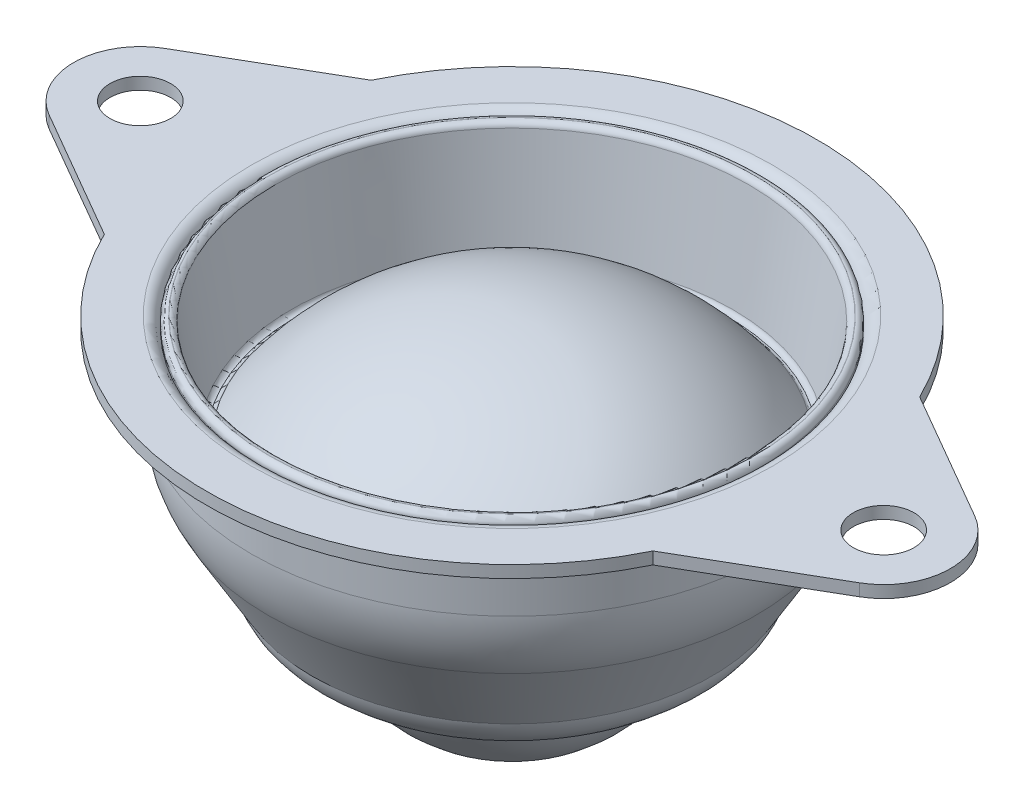
ISO-10303-21;
HEADER;
FILE_DESCRIPTION(('STEP AP214'),'2;1');
FILE_NAME('part.step','',(''),(''),'','','');
FILE_SCHEMA(('AUTOMOTIVE_DESIGN { 1 0 10303 214 1 1 1 1 }'));
ENDSEC;
DATA;
#1=APPLICATION_CONTEXT('core data for automotive mechanical design processes');
#2=APPLICATION_PROTOCOL_DEFINITION('international standard','automotive_design',2000,#1);
#3=PRODUCT_CONTEXT('',#1,'mechanical');
#4=PRODUCT('Part','Part','',(#3));
#5=PRODUCT_RELATED_PRODUCT_CATEGORY('part','',(#4));
#6=PRODUCT_DEFINITION_FORMATION('','',#4);
#7=PRODUCT_DEFINITION_CONTEXT('part definition',#1,'design');
#8=PRODUCT_DEFINITION('design','',#6,#7);
#9=PRODUCT_DEFINITION_SHAPE('','',#8);
#10=(LENGTH_UNIT() NAMED_UNIT(*) SI_UNIT(.MILLI.,.METRE.));
#11=(NAMED_UNIT(*) PLANE_ANGLE_UNIT() SI_UNIT($,.RADIAN.));
#12=(NAMED_UNIT(*) SI_UNIT($,.STERADIAN.) SOLID_ANGLE_UNIT());
#13=UNCERTAINTY_MEASURE_WITH_UNIT(LENGTH_MEASURE(1.E-05),#10,'distance_accuracy_value','');
#14=(GEOMETRIC_REPRESENTATION_CONTEXT(3) GLOBAL_UNCERTAINTY_ASSIGNED_CONTEXT((#13)) GLOBAL_UNIT_ASSIGNED_CONTEXT((#10,
#11,#12)) REPRESENTATION_CONTEXT('',''));
#15=CARTESIAN_POINT('',(0.,0.,0.));
#16=DIRECTION('',(0.,0.,1.));
#17=DIRECTION('',(1.,0.,0.));
#18=AXIS2_PLACEMENT_3D('',#15,#16,#17);
#19=CARTESIAN_POINT('',(0.,-16.85,0.));
#20=DIRECTION('',(0.,1.,0.));
#21=DIRECTION('',(0.,0.,1.));
#22=AXIS2_PLACEMENT_3D('',#19,#20,#21);
#23=SPHERICAL_SURFACE('',#22,12.25);
#24=CARTESIAN_POINT('',(0.,-4.6,0.));
#25=VERTEX_POINT('',#24);
#26=VERTEX_LOOP('',#25);
#27=FACE_BOUND('',#26,.T.);
#28=ADVANCED_FACE('F39',(#27),#23,.T.);
#29=CLOSED_SHELL('',(#28));
#30=MANIFOLD_SOLID_BREP('B2',#29);
#31=CARTESIAN_POINT('',(0.,-21.7088888888889,0.));
#32=DIRECTION('',(0.,1.,0.));
#33=DIRECTION('',(0.,0.,1.));
#34=AXIS2_PLACEMENT_3D('',#31,#32,#33);
#35=SPHERICAL_SURFACE('',#34,21.7088888888889);
#36=CARTESIAN_POINT('',(0.,-8.83716956478038,0.));
#37=DIRECTION('',(0.,1.,0.));
#38=DIRECTION('',(0.,0.,1.));
#39=AXIS2_PLACEMENT_3D('',#36,#37,#38);
#40=CIRCLE('',#39,17.4812670716826);
#41=CARTESIAN_POINT('',(0.,-8.83716956478038,17.4812670716826));
#42=VERTEX_POINT('',#41);
#43=EDGE_CURVE('E94',#42,#42,#40,.T.);
#44=ORIENTED_EDGE('',*,*,#43,.T.);
#45=EDGE_LOOP('',(#44));
#46=FACE_BOUND('',#45,.T.);
#47=ADVANCED_FACE('F60',(#46),#35,.T.);
#48=CARTESIAN_POINT('',(0.,-22.7088888888889,0.));
#49=DIRECTION('',(0.,1.,0.));
#50=DIRECTION('',(0.,0.,1.));
#51=AXIS2_PLACEMENT_3D('',#48,#49,#50);
#52=SPHERICAL_SURFACE('',#51,21.7088888888889);
#53=CARTESIAN_POINT('',(0.,-10.,0.));
#54=DIRECTION('',(0.,1.,0.));
#55=DIRECTION('',(0.,0.,1.));
#56=AXIS2_PLACEMENT_3D('',#53,#54,#55);
#57=CIRCLE('',#56,17.6);
#58=CARTESIAN_POINT('',(0.,-10.,17.6));
#59=VERTEX_POINT('',#58);
#60=EDGE_CURVE('E38',#59,#59,#57,.T.);
#61=ORIENTED_EDGE('',*,*,#60,.F.);
#62=EDGE_LOOP('',(#61));
#63=FACE_BOUND('',#62,.T.);
#64=ADVANCED_FACE('F111',(#63),#52,.F.);
#65=CARTESIAN_POINT('',(0.,-10.,19.));
#66=DIRECTION('',(0.,-1.,0.));
#67=DIRECTION('',(0.,0.,-1.));
#68=AXIS2_PLACEMENT_3D('',#65,#66,#67);
#69=PLANE('',#68);
#70=ORIENTED_EDGE('',*,*,#60,.T.);
#71=EDGE_LOOP('',(#70));
#72=FACE_BOUND('',#71,.T.);
#73=CARTESIAN_POINT('',(0.,-10.,0.));
#74=DIRECTION('',(0.,1.,0.));
#75=DIRECTION('',(0.,0.,1.));
#76=AXIS2_PLACEMENT_3D('',#73,#74,#75);
#77=CIRCLE('',#76,19.);
#78=CARTESIAN_POINT('',(0.,-10.,19.));
#79=VERTEX_POINT('',#78);
#80=EDGE_CURVE('E66',#79,#79,#77,.T.);
#81=ORIENTED_EDGE('',*,*,#80,.F.);
#82=EDGE_LOOP('',(#81));
#83=FACE_BOUND('',#82,.T.);
#84=ADVANCED_FACE('F115',(#72,#83),#69,.T.);
#85=CARTESIAN_POINT('',(0.,-0.567415345542272,0.));
#86=DIRECTION('',(0.,1.,0.));
#87=DIRECTION('',(0.,0.,1.));
#88=AXIS2_PLACEMENT_3D('',#85,#86,#87);
#89=CONICAL_SURFACE('',#88,20.5092135447132,0.158655262186401);
#90=ORIENTED_EDGE('',*,*,#80,.T.);
#91=EDGE_LOOP('',(#90));
#92=FACE_BOUND('',#91,.T.);
#93=CARTESIAN_POINT('',(0.,-0.567415345542272,0.));
#94=DIRECTION('',(0.,1.,0.));
#95=DIRECTION('',(0.,0.,1.));
#96=AXIS2_PLACEMENT_3D('',#93,#94,#95);
#97=CIRCLE('',#96,20.5092135447132);
#98=CARTESIAN_POINT('',(0.,-0.567415345542271,20.5092135447132));
#99=VERTEX_POINT('',#98);
#100=EDGE_CURVE('E70',#99,#99,#97,.T.);
#101=ORIENTED_EDGE('',*,*,#100,.F.);
#102=EDGE_LOOP('',(#101));
#103=FACE_BOUND('',#102,.T.);
#104=ADVANCED_FACE('F120',(#92,#103),#89,.T.);
#105=CARTESIAN_POINT('',(0.,-0.489999999999999,0.));
#106=DIRECTION('',(0.,1.,0.));
#107=DIRECTION('',(0.,0.,1.));
#108=AXIS2_PLACEMENT_3D('',#105,#106,#107);
#109=TOROIDAL_SURFACE('',#108,20.0253676350741,0.489999999999999);
#110=ORIENTED_EDGE('',*,*,#100,.T.);
#111=EDGE_LOOP('',(#110));
#112=FACE_BOUND('',#111,.T.);
#113=CARTESIAN_POINT('',(0.,0.,0.));
#114=DIRECTION('',(0.,1.,0.));
#115=DIRECTION('',(0.,0.,1.));
#116=AXIS2_PLACEMENT_3D('',#113,#114,#115);
#117=CIRCLE('',#116,20.025367635074);
#118=CARTESIAN_POINT('',(0.,0.,20.025367635074));
#119=VERTEX_POINT('',#118);
#120=EDGE_CURVE('E74',#119,#119,#117,.T.);
#121=ORIENTED_EDGE('',*,*,#120,.F.);
#122=EDGE_LOOP('',(#121));
#123=FACE_BOUND('',#122,.T.);
#124=ADVANCED_FACE('F125',(#112,#123),#109,.T.);
#125=CARTESIAN_POINT('',(0.,0.,20.025367635074));
#126=DIRECTION('',(0.,1.,0.));
#127=DIRECTION('',(0.,0.,1.));
#128=AXIS2_PLACEMENT_3D('',#125,#126,#127);
#129=PLANE('',#128);
#130=ORIENTED_EDGE('',*,*,#120,.T.);
#131=EDGE_LOOP('',(#130));
#132=FACE_BOUND('',#131,.T.);
#133=CARTESIAN_POINT('',(0.,0.,0.));
#134=DIRECTION('',(0.,1.,0.));
#135=DIRECTION('',(0.,0.,1.));
#136=AXIS2_PLACEMENT_3D('',#133,#134,#135);
#137=CIRCLE('',#136,20.0051132528322);
#138=CARTESIAN_POINT('',(0.,0.,20.0051132528322));
#139=VERTEX_POINT('',#138);
#140=EDGE_CURVE('E79',#139,#139,#137,.T.);
#141=ORIENTED_EDGE('',*,*,#140,.F.);
#142=EDGE_LOOP('',(#141));
#143=FACE_BOUND('',#142,.T.);
#144=ADVANCED_FACE('F128',(#132,#143),#129,.T.);
#145=CARTESIAN_POINT('',(0.,-0.489999999999999,0.));
#146=DIRECTION('',(0.,1.,0.));
#147=DIRECTION('',(0.,0.,1.));
#148=AXIS2_PLACEMENT_3D('',#145,#146,#147);
#149=TOROIDAL_SURFACE('',#148,20.0051132528322,0.49);
#150=ORIENTED_EDGE('',*,*,#140,.T.);
#151=EDGE_LOOP('',(#150));
#152=FACE_BOUND('',#151,.T.);
#153=CARTESIAN_POINT('',(0.,-0.412584654457732,0.));
#154=DIRECTION('',(0.,1.,0.));
#155=DIRECTION('',(0.,0.,1.));
#156=AXIS2_PLACEMENT_3D('',#153,#154,#155);
#157=CIRCLE('',#156,19.521267343193);
#158=CARTESIAN_POINT('',(0.,-0.41258465445773,19.521267343193));
#159=VERTEX_POINT('',#158);
#160=EDGE_CURVE('E82',#159,#159,#157,.T.);
#161=ORIENTED_EDGE('',*,*,#160,.F.);
#162=EDGE_LOOP('',(#161));
#163=FACE_BOUND('',#162,.T.);
#164=ADVANCED_FACE('F132',(#152,#163),#149,.T.);
#165=CARTESIAN_POINT('',(0.,-8.66319620044267,0.));
#166=DIRECTION('',(0.,1.,0.));
#167=DIRECTION('',(0.,0.,1.));
#168=AXIS2_PLACEMENT_3D('',#165,#166,#167);
#169=CONICAL_SURFACE('',#168,18.2011694958354,0.158655262186401);
#170=ORIENTED_EDGE('',*,*,#160,.T.);
#171=EDGE_LOOP('',(#170));
#172=FACE_BOUND('',#171,.T.);
#173=CARTESIAN_POINT('',(0.,-8.66319620044267,0.));
#174=DIRECTION('',(0.,1.,0.));
#175=DIRECTION('',(0.,0.,1.));
#176=AXIS2_PLACEMENT_3D('',#173,#174,#175);
#177=CIRCLE('',#176,18.2011694958354);
#178=CARTESIAN_POINT('',(0.,-8.66319620044267,18.2011694958354));
#179=VERTEX_POINT('',#178);
#180=EDGE_CURVE('E85',#179,#179,#177,.T.);
#181=ORIENTED_EDGE('',*,*,#180,.F.);
#182=EDGE_LOOP('',(#181));
#183=FACE_BOUND('',#182,.T.);
#184=ADVANCED_FACE('F136',(#172,#183),#169,.F.);
#185=CARTESIAN_POINT('',(0.,-8.6,0.));
#186=DIRECTION('',(0.,1.,0.));
#187=DIRECTION('',(0.,0.,1.));
#188=AXIS2_PLACEMENT_3D('',#185,#186,#187);
#189=TOROIDAL_SURFACE('',#188,17.8061932430687,0.400000000000001);
#190=ORIENTED_EDGE('',*,*,#180,.T.);
#191=EDGE_LOOP('',(#190));
#192=FACE_BOUND('',#191,.T.);
#193=CARTESIAN_POINT('',(0.,-9.00000000000001,0.));
#194=DIRECTION('',(0.,1.,0.));
#195=DIRECTION('',(0.,0.,1.));
#196=AXIS2_PLACEMENT_3D('',#193,#194,#195);
#197=CIRCLE('',#196,17.8061932430687);
#198=CARTESIAN_POINT('',(0.,-9.,17.8061932430687));
#199=VERTEX_POINT('',#198);
#200=EDGE_CURVE('E88',#199,#199,#197,.T.);
#201=ORIENTED_EDGE('',*,*,#200,.F.);
#202=EDGE_LOOP('',(#201));
#203=FACE_BOUND('',#202,.T.);
#204=ADVANCED_FACE('F107',(#192,#203),#189,.F.);
#205=CARTESIAN_POINT('',(0.,-9.,17.8061932430687));
#206=DIRECTION('',(0.,1.,0.));
#207=DIRECTION('',(0.,0.,1.));
#208=AXIS2_PLACEMENT_3D('',#205,#206,#207);
#209=PLANE('',#208);
#210=ORIENTED_EDGE('',*,*,#200,.T.);
#211=EDGE_LOOP('',(#210));
#212=FACE_BOUND('',#211,.T.);
#213=CARTESIAN_POINT('',(0.,-9.,0.));
#214=DIRECTION('',(0.,1.,0.));
#215=DIRECTION('',(0.,0.,1.));
#216=AXIS2_PLACEMENT_3D('',#213,#214,#215);
#217=CIRCLE('',#216,17.8033704674143);
#218=CARTESIAN_POINT('',(0.,-9.,17.8033704674143));
#219=VERTEX_POINT('',#218);
#220=EDGE_CURVE('E91',#219,#219,#217,.T.);
#221=ORIENTED_EDGE('',*,*,#220,.F.);
#222=EDGE_LOOP('',(#221));
#223=FACE_BOUND('',#222,.T.);
#224=ADVANCED_FACE('F101',(#212,#223),#209,.T.);
#225=CARTESIAN_POINT('',(0.,-8.6,0.));
#226=DIRECTION('',(0.,1.,0.));
#227=DIRECTION('',(0.,0.,1.));
#228=AXIS2_PLACEMENT_3D('',#225,#226,#227);
#229=TOROIDAL_SURFACE('',#228,17.8033704674143,0.400000000000001);
#230=ORIENTED_EDGE('',*,*,#220,.T.);
#231=EDGE_LOOP('',(#230));
#232=FACE_BOUND('',#231,.T.);
#233=ORIENTED_EDGE('',*,*,#43,.F.);
#234=EDGE_LOOP('',(#233));
#235=FACE_BOUND('',#234,.T.);
#236=ADVANCED_FACE('F99',(#232,#235),#229,.F.);
#237=CLOSED_SHELL('',(#47,#64,#84,#104,#124,#144,#164,#184,#204,#224,#236));
#238=MANIFOLD_SOLID_BREP('B7',#237);
#239=CARTESIAN_POINT('',(0.,0.,0.));
#240=DIRECTION('',(0.,1.,0.));
#241=DIRECTION('',(0.,0.,1.));
#242=AXIS2_PLACEMENT_3D('',#239,#240,#241);
#243=CYLINDRICAL_SURFACE('',#242,25.15);
#244=DIRECTION('',(0.,1.,0.));
#245=VECTOR('',#244,1.);
#246=CARTESIAN_POINT('',(-22.6168631777265,-1.,11.));
#247=LINE('',#246,#245);
#248=CARTESIAN_POINT('',(-22.6168631777265,-1.,11.));
#249=VERTEX_POINT('',#248);
#250=CARTESIAN_POINT('',(-22.6168631777265,0.,11.));
#251=VERTEX_POINT('',#250);
#252=EDGE_CURVE('E319',#249,#251,#247,.T.);
#253=ORIENTED_EDGE('',*,*,#252,.F.);
#254=CARTESIAN_POINT('',(0.,-1.,0.));
#255=DIRECTION('',(0.,1.,0.));
#256=DIRECTION('',(0.,0.,1.));
#257=AXIS2_PLACEMENT_3D('',#254,#255,#256);
#258=CIRCLE('',#257,25.15);
#259=CARTESIAN_POINT('',(22.6168631777265,-1.,11.));
#260=VERTEX_POINT('',#259);
#261=EDGE_CURVE('E350',#249,#260,#258,.T.);
#262=ORIENTED_EDGE('',*,*,#261,.T.);
#263=DIRECTION('',(0.,1.,0.));
#264=VECTOR('',#263,1.);
#265=CARTESIAN_POINT('',(22.6168631777265,-1.,11.));
#266=LINE('',#265,#264);
#267=CARTESIAN_POINT('',(22.6168631777265,0.,11.));
#268=VERTEX_POINT('',#267);
#269=EDGE_CURVE('E351',#260,#268,#266,.T.);
#270=ORIENTED_EDGE('',*,*,#269,.T.);
#271=CARTESIAN_POINT('',(0.,0.,0.));
#272=DIRECTION('',(0.,1.,0.));
#273=DIRECTION('',(0.,0.,1.));
#274=AXIS2_PLACEMENT_3D('',#271,#272,#273);
#275=CIRCLE('',#274,25.15);
#276=EDGE_CURVE('E228',#251,#268,#275,.T.);
#277=ORIENTED_EDGE('',*,*,#276,.F.);
#278=EDGE_LOOP('',(#253,#262,#270,#277));
#279=FACE_BOUND('',#278,.T.);
#280=ADVANCED_FACE('F220',(#279),#243,.T.);
#281=DIRECTION('',(0.,1.,0.));
#282=VECTOR('',#281,1.);
#283=CARTESIAN_POINT('',(-22.6168631777265,-0.999999999999999,-11.));
#284=LINE('',#283,#282);
#285=CARTESIAN_POINT('',(-22.6168631777265,-0.999999999999999,-11.));
#286=VERTEX_POINT('',#285);
#287=CARTESIAN_POINT('',(-22.6168631777265,0.,-11.));
#288=VERTEX_POINT('',#287);
#289=EDGE_CURVE('E242',#286,#288,#284,.T.);
#290=ORIENTED_EDGE('',*,*,#289,.T.);
#291=CARTESIAN_POINT('',(22.6168631777265,0.,-11.));
#292=VERTEX_POINT('',#291);
#293=EDGE_CURVE('E58',#292,#288,#275,.T.);
#294=ORIENTED_EDGE('',*,*,#293,.F.);
#295=DIRECTION('',(0.,1.,0.));
#296=VECTOR('',#295,1.);
#297=CARTESIAN_POINT('',(22.6168631777265,-0.999999999999999,-11.));
#298=LINE('',#297,#296);
#299=CARTESIAN_POINT('',(22.6168631777265,-0.999999999999999,-11.));
#300=VERTEX_POINT('',#299);
#301=EDGE_CURVE('E353',#300,#292,#298,.T.);
#302=ORIENTED_EDGE('',*,*,#301,.F.);
#303=EDGE_CURVE('E357',#300,#286,#258,.T.);
#304=ORIENTED_EDGE('',*,*,#303,.T.);
#305=EDGE_LOOP('',(#290,#294,#302,#304));
#306=FACE_BOUND('',#305,.T.);
#307=ADVANCED_FACE('F222',(#306),#243,.T.);
#308=CARTESIAN_POINT('',(0.,0.,21.5));
#309=DIRECTION('',(0.,1.,0.));
#310=DIRECTION('',(0.,0.,1.));
#311=AXIS2_PLACEMENT_3D('',#308,#309,#310);
#312=PLANE('',#311);
#313=ORIENTED_EDGE('',*,*,#293,.T.);
#314=DIRECTION('',(-0.865635422715668,0.,0.500674859504516));
#315=VECTOR('',#314,1.);
#316=CARTESIAN_POINT('',(-33.4037117272748,0.,-4.76099482493617));
#317=LINE('',#316,#315);
#318=CARTESIAN_POINT('',(-33.4037117272748,0.,-4.76099482493617));
#319=VERTEX_POINT('',#318);
#320=EDGE_CURVE('E315',#288,#319,#317,.T.);
#321=ORIENTED_EDGE('',*,*,#320,.T.);
#322=CARTESIAN_POINT('',(-30.65,0.,0.));
#323=DIRECTION('',(0.,1.,0.));
#324=DIRECTION('',(0.,0.,-1.));
#325=AXIS2_PLACEMENT_3D('',#322,#323,#324);
#326=CIRCLE('',#325,5.5);
#327=CARTESIAN_POINT('',(-33.4037117272748,0.,4.76099482493617));
#328=VERTEX_POINT('',#327);
#329=EDGE_CURVE('E290',#319,#328,#326,.T.);
#330=ORIENTED_EDGE('',*,*,#329,.T.);
#331=DIRECTION('',(0.865635422715668,0.,0.500674859504516));
#332=VECTOR('',#331,1.);
#333=CARTESIAN_POINT('',(-22.6168631777265,0.,11.));
#334=LINE('',#333,#332);
#335=EDGE_CURVE('E306',#328,#251,#334,.T.);
#336=ORIENTED_EDGE('',*,*,#335,.T.);
#337=ORIENTED_EDGE('',*,*,#276,.T.);
#338=DIRECTION('',(0.865635422715668,0.,-0.500674859504516));
#339=VECTOR('',#338,1.);
#340=CARTESIAN_POINT('',(22.6168631777265,0.,11.));
#341=LINE('',#340,#339);
#342=CARTESIAN_POINT('',(33.4037117272748,0.,4.76099482493618));
#343=VERTEX_POINT('',#342);
#344=EDGE_CURVE('E334',#268,#343,#341,.T.);
#345=ORIENTED_EDGE('',*,*,#344,.T.);
#346=CARTESIAN_POINT('',(30.65,0.,0.));
#347=DIRECTION('',(0.,1.,0.));
#348=DIRECTION('',(0.,0.,1.));
#349=AXIS2_PLACEMENT_3D('',#346,#347,#348);
#350=CIRCLE('',#349,5.5);
#351=CARTESIAN_POINT('',(33.4037117272748,0.,-4.76099482493617));
#352=VERTEX_POINT('',#351);
#353=EDGE_CURVE('E327',#343,#352,#350,.T.);
#354=ORIENTED_EDGE('',*,*,#353,.T.);
#355=DIRECTION('',(-0.865635422715668,0.,-0.500674859504516));
#356=VECTOR('',#355,1.);
#357=CARTESIAN_POINT('',(33.4037117272748,0.,-4.76099482493617));
#358=LINE('',#357,#356);
#359=EDGE_CURVE('E343',#352,#292,#358,.T.);
#360=ORIENTED_EDGE('',*,*,#359,.T.);
#361=EDGE_LOOP('',(#313,#321,#330,#336,#337,#345,#354,#360));
#362=FACE_BOUND('',#361,.T.);
#363=CARTESIAN_POINT('',(0.,0.,0.));
#364=DIRECTION('',(0.,1.,0.));
#365=DIRECTION('',(0.,0.,1.));
#366=AXIS2_PLACEMENT_3D('',#363,#364,#365);
#367=CIRCLE('',#366,21.5);
#368=CARTESIAN_POINT('',(0.,0.,21.5));
#369=VERTEX_POINT('',#368);
#370=EDGE_CURVE('E391',#369,#369,#367,.T.);
#371=ORIENTED_EDGE('',*,*,#370,.F.);
#372=EDGE_LOOP('',(#371));
#373=FACE_BOUND('',#372,.T.);
#374=CARTESIAN_POINT('',(30.65,0.,0.));
#375=DIRECTION('',(0.,1.,0.));
#376=DIRECTION('',(0.,0.,1.));
#377=AXIS2_PLACEMENT_3D('',#374,#375,#376);
#378=CIRCLE('',#377,2.5);
#379=CARTESIAN_POINT('',(30.65,0.,2.5));
#380=VERTEX_POINT('',#379);
#381=EDGE_CURVE('E321',#380,#380,#378,.T.);
#382=ORIENTED_EDGE('',*,*,#381,.F.);
#383=EDGE_LOOP('',(#382));
#384=FACE_BOUND('',#383,.T.);
#385=CARTESIAN_POINT('',(-30.65,0.,0.));
#386=DIRECTION('',(0.,1.,0.));
#387=DIRECTION('',(0.,0.,-1.));
#388=AXIS2_PLACEMENT_3D('',#385,#386,#387);
#389=CIRCLE('',#388,2.5);
#390=CARTESIAN_POINT('',(-30.65,0.,-2.5));
#391=VERTEX_POINT('',#390);
#392=EDGE_CURVE('E311',#391,#391,#389,.T.);
#393=ORIENTED_EDGE('',*,*,#392,.F.);
#394=EDGE_LOOP('',(#393));
#395=FACE_BOUND('',#394,.T.);
#396=ADVANCED_FACE('F396',(#362,#373,#384,#395),#312,.T.);
#397=CARTESIAN_POINT('',(0.,-1.,0.));
#398=DIRECTION('',(0.,1.,0.));
#399=DIRECTION('',(0.,0.,1.));
#400=AXIS2_PLACEMENT_3D('',#397,#398,#399);
#401=TOROIDAL_SURFACE('',#400,21.5,1.);
#402=ORIENTED_EDGE('',*,*,#370,.T.);
#403=EDGE_LOOP('',(#402));
#404=FACE_BOUND('',#403,.T.);
#405=CARTESIAN_POINT('',(0.,-1.00000000000001,0.));
#406=DIRECTION('',(0.,1.,0.));
#407=DIRECTION('',(0.,0.,1.));
#408=AXIS2_PLACEMENT_3D('',#405,#406,#407);
#409=CIRCLE('',#408,20.5);
#410=CARTESIAN_POINT('',(0.,-1.00000000000001,20.5));
#411=VERTEX_POINT('',#410);
#412=EDGE_CURVE('E389',#411,#411,#409,.T.);
#413=ORIENTED_EDGE('',*,*,#412,.F.);
#414=EDGE_LOOP('',(#413));
#415=FACE_BOUND('',#414,.T.);
#416=ADVANCED_FACE('F433',(#404,#415),#401,.T.);
#417=CARTESIAN_POINT('',(0.,0.,0.));
#418=DIRECTION('',(0.,1.,0.));
#419=DIRECTION('',(0.,0.,1.));
#420=AXIS2_PLACEMENT_3D('',#417,#418,#419);
#421=CYLINDRICAL_SURFACE('',#420,20.5);
#422=ORIENTED_EDGE('',*,*,#412,.T.);
#423=EDGE_LOOP('',(#422));
#424=FACE_BOUND('',#423,.T.);
#425=CARTESIAN_POINT('',(0.,-5.68868178256629,0.));
#426=DIRECTION('',(0.,1.,0.));
#427=DIRECTION('',(0.,0.,1.));
#428=AXIS2_PLACEMENT_3D('',#425,#426,#427);
#429=CIRCLE('',#428,20.5);
#430=CARTESIAN_POINT('',(0.,-5.68868178256629,20.5));
#431=VERTEX_POINT('',#430);
#432=EDGE_CURVE('E386',#431,#431,#429,.T.);
#433=ORIENTED_EDGE('',*,*,#432,.F.);
#434=EDGE_LOOP('',(#433));
#435=FACE_BOUND('',#434,.T.);
#436=ADVANCED_FACE('F437',(#424,#435),#421,.F.);
#437=CARTESIAN_POINT('',(0.,-5.68868178256633,0.));
#438=DIRECTION('',(0.,1.,0.));
#439=DIRECTION('',(0.,0.,1.));
#440=AXIS2_PLACEMENT_3D('',#437,#438,#439);
#441=TOROIDAL_SURFACE('',#440,10.5,10.);
#442=ORIENTED_EDGE('',*,*,#432,.T.);
#443=EDGE_LOOP('',(#442));
#444=FACE_BOUND('',#443,.T.);
#445=CARTESIAN_POINT('',(0.,-10.7588830482003,0.));
#446=DIRECTION('',(0.,1.,0.));
#447=DIRECTION('',(0.,0.,1.));
#448=AXIS2_PLACEMENT_3D('',#445,#446,#447);
#449=CIRCLE('',#448,19.1193421515777);
#450=CARTESIAN_POINT('',(0.,-10.7588830482003,19.1193421515777));
#451=VERTEX_POINT('',#450);
#452=EDGE_CURVE('E383',#451,#451,#449,.T.);
#453=ORIENTED_EDGE('',*,*,#452,.F.);
#454=EDGE_LOOP('',(#453));
#455=FACE_BOUND('',#454,.T.);
#456=ADVANCED_FACE('F442',(#444,#455),#441,.F.);
#457=CARTESIAN_POINT('',(0.,-16.9117647058824,0.));
#458=DIRECTION('',(0.,1.,0.));
#459=DIRECTION('',(0.,0.,1.));
#460=AXIS2_PLACEMENT_3D('',#457,#458,#459);
#461=CONICAL_SURFACE('',#460,15.5,0.531724067258805);
#462=ORIENTED_EDGE('',*,*,#452,.T.);
#463=EDGE_LOOP('',(#462));
#464=FACE_BOUND('',#463,.T.);
#465=CARTESIAN_POINT('',(0.,-16.9117647058824,0.));
#466=DIRECTION('',(0.,1.,0.));
#467=DIRECTION('',(0.,0.,1.));
#468=AXIS2_PLACEMENT_3D('',#465,#466,#467);
#469=CIRCLE('',#468,15.5);
#470=CARTESIAN_POINT('',(0.,-16.9117647058824,15.5));
#471=VERTEX_POINT('',#470);
#472=EDGE_CURVE('E380',#471,#471,#469,.T.);
#473=ORIENTED_EDGE('',*,*,#472,.F.);
#474=EDGE_LOOP('',(#473));
#475=FACE_BOUND('',#474,.T.);
#476=ADVANCED_FACE('F446',(#464,#475),#461,.F.);
#477=CARTESIAN_POINT('',(0.,-14.0934589058721,0.));
#478=DIRECTION('',(0.,1.,0.));
#479=DIRECTION('',(0.,0.,1.));
#480=AXIS2_PLACEMENT_3D('',#477,#478,#479);
#481=TOROIDAL_SURFACE('',#480,10.7088801399825,5.55856789968655);
#482=ORIENTED_EDGE('',*,*,#472,.T.);
#483=EDGE_LOOP('',(#482));
#484=FACE_BOUND('',#483,.T.);
#485=CARTESIAN_POINT('',(0.,-19.5,0.));
#486=DIRECTION('',(0.,1.,0.));
#487=DIRECTION('',(0.,0.,1.));
#488=AXIS2_PLACEMENT_3D('',#485,#486,#487);
#489=CIRCLE('',#488,12.);
#490=CARTESIAN_POINT('',(0.,-19.5,12.));
#491=VERTEX_POINT('',#490);
#492=EDGE_CURVE('E377',#491,#491,#489,.T.);
#493=ORIENTED_EDGE('',*,*,#492,.F.);
#494=EDGE_LOOP('',(#493));
#495=FACE_BOUND('',#494,.T.);
#496=ADVANCED_FACE('F450',(#484,#495),#481,.F.);
#497=CARTESIAN_POINT('',(0.,0.,0.));
#498=DIRECTION('',(0.,1.,0.));
#499=DIRECTION('',(0.,0.,1.));
#500=AXIS2_PLACEMENT_3D('',#497,#498,#499);
#501=CYLINDRICAL_SURFACE('',#500,12.);
#502=ORIENTED_EDGE('',*,*,#492,.T.);
#503=EDGE_LOOP('',(#502));
#504=FACE_BOUND('',#503,.T.);
#505=CARTESIAN_POINT('',(0.,-20.5,0.));
#506=DIRECTION('',(0.,1.,0.));
#507=DIRECTION('',(0.,0.,1.));
#508=AXIS2_PLACEMENT_3D('',#505,#506,#507);
#509=CIRCLE('',#508,12.);
#510=CARTESIAN_POINT('',(0.,-20.5,12.));
#511=VERTEX_POINT('',#510);
#512=EDGE_CURVE('E374',#511,#511,#509,.T.);
#513=ORIENTED_EDGE('',*,*,#512,.F.);
#514=EDGE_LOOP('',(#513));
#515=FACE_BOUND('',#514,.T.);
#516=ADVANCED_FACE('F454',(#504,#515),#501,.F.);
#517=CARTESIAN_POINT('',(0.,-16.5475679261347,0.));
#518=DIRECTION('',(0.,1.,0.));
#519=DIRECTION('',(0.,0.,1.));
#520=AXIS2_PLACEMENT_3D('',#517,#518,#519);
#521=TOROIDAL_SURFACE('',#520,12.6150452840898,4.);
#522=ORIENTED_EDGE('',*,*,#512,.T.);
#523=EDGE_LOOP('',(#522));
#524=FACE_BOUND('',#523,.T.);
#525=CARTESIAN_POINT('',(0.,-17.5,0.));
#526=DIRECTION('',(0.,1.,0.));
#527=DIRECTION('',(0.,0.,1.));
#528=AXIS2_PLACEMENT_3D('',#525,#526,#527);
#529=CIRCLE('',#528,16.5);
#530=CARTESIAN_POINT('',(0.,-17.5,16.5));
#531=VERTEX_POINT('',#530);
#532=EDGE_CURVE('E371',#531,#531,#529,.T.);
#533=ORIENTED_EDGE('',*,*,#532,.F.);
#534=EDGE_LOOP('',(#533));
#535=FACE_BOUND('',#534,.T.);
#536=ADVANCED_FACE('F458',(#524,#535),#521,.T.);
#537=CARTESIAN_POINT('',(0.,-11.347118342318,0.));
#538=DIRECTION('',(0.,1.,0.));
#539=DIRECTION('',(0.,0.,1.));
#540=AXIS2_PLACEMENT_3D('',#537,#538,#539);
#541=CONICAL_SURFACE('',#540,20.1193421515777,0.531724067258805);
#542=ORIENTED_EDGE('',*,*,#532,.T.);
#543=EDGE_LOOP('',(#542));
#544=FACE_BOUND('',#543,.T.);
#545=CARTESIAN_POINT('',(0.,-11.347118342318,0.));
#546=DIRECTION('',(0.,1.,0.));
#547=DIRECTION('',(0.,0.,1.));
#548=AXIS2_PLACEMENT_3D('',#545,#546,#547);
#549=CIRCLE('',#548,20.1193421515777);
#550=CARTESIAN_POINT('',(0.,-11.347118342318,20.1193421515777));
#551=VERTEX_POINT('',#550);
#552=EDGE_CURVE('E368',#551,#551,#549,.T.);
#553=ORIENTED_EDGE('',*,*,#552,.F.);
#554=EDGE_LOOP('',(#553));
#555=FACE_BOUND('',#554,.T.);
#556=ADVANCED_FACE('F462',(#544,#555),#541,.T.);
#557=CARTESIAN_POINT('',(0.,-6.27691707668398,0.));
#558=DIRECTION('',(0.,1.,0.));
#559=DIRECTION('',(0.,0.,1.));
#560=AXIS2_PLACEMENT_3D('',#557,#558,#559);
#561=TOROIDAL_SURFACE('',#560,11.5,10.);
#562=ORIENTED_EDGE('',*,*,#552,.T.);
#563=EDGE_LOOP('',(#562));
#564=FACE_BOUND('',#563,.T.);
#565=CARTESIAN_POINT('',(0.,-6.27691707668394,0.));
#566=DIRECTION('',(0.,1.,0.));
#567=DIRECTION('',(0.,0.,1.));
#568=AXIS2_PLACEMENT_3D('',#565,#566,#567);
#569=CIRCLE('',#568,21.5);
#570=CARTESIAN_POINT('',(0.,-6.27691707668395,21.5));
#571=VERTEX_POINT('',#570);
#572=EDGE_CURVE('E365',#571,#571,#569,.T.);
#573=ORIENTED_EDGE('',*,*,#572,.F.);
#574=EDGE_LOOP('',(#573));
#575=FACE_BOUND('',#574,.T.);
#576=ADVANCED_FACE('F466',(#564,#575),#561,.T.);
#577=CARTESIAN_POINT('',(0.,0.,0.));
#578=DIRECTION('',(0.,1.,0.));
#579=DIRECTION('',(0.,0.,1.));
#580=AXIS2_PLACEMENT_3D('',#577,#578,#579);
#581=CYLINDRICAL_SURFACE('',#580,21.5);
#582=ORIENTED_EDGE('',*,*,#572,.T.);
#583=EDGE_LOOP('',(#582));
#584=FACE_BOUND('',#583,.T.);
#585=CARTESIAN_POINT('',(0.,-2.00000000000001,0.));
#586=DIRECTION('',(0.,1.,0.));
#587=DIRECTION('',(0.,0.,1.));
#588=AXIS2_PLACEMENT_3D('',#585,#586,#587);
#589=CIRCLE('',#588,21.5);
#590=CARTESIAN_POINT('',(0.,-2.00000000000001,21.5));
#591=VERTEX_POINT('',#590);
#592=EDGE_CURVE('E362',#591,#591,#589,.T.);
#593=ORIENTED_EDGE('',*,*,#592,.F.);
#594=EDGE_LOOP('',(#593));
#595=FACE_BOUND('',#594,.T.);
#596=ADVANCED_FACE('F470',(#584,#595),#581,.T.);
#597=CARTESIAN_POINT('',(0.,-2.,0.));
#598=DIRECTION('',(0.,1.,0.));
#599=DIRECTION('',(0.,0.,1.));
#600=AXIS2_PLACEMENT_3D('',#597,#598,#599);
#601=TOROIDAL_SURFACE('',#600,22.5,1.);
#602=ORIENTED_EDGE('',*,*,#592,.T.);
#603=EDGE_LOOP('',(#602));
#604=FACE_BOUND('',#603,.T.);
#605=CARTESIAN_POINT('',(0.,-1.,0.));
#606=DIRECTION('',(0.,1.,0.));
#607=DIRECTION('',(0.,0.,1.));
#608=AXIS2_PLACEMENT_3D('',#605,#606,#607);
#609=CIRCLE('',#608,22.5);
#610=CARTESIAN_POINT('',(0.,-1.,22.5));
#611=VERTEX_POINT('',#610);
#612=EDGE_CURVE('E359',#611,#611,#609,.T.);
#613=ORIENTED_EDGE('',*,*,#612,.F.);
#614=EDGE_LOOP('',(#613));
#615=FACE_BOUND('',#614,.T.);
#616=ADVANCED_FACE('F474',(#604,#615),#601,.F.);
#617=CARTESIAN_POINT('',(0.,-1.,25.15));
#618=DIRECTION('',(0.,-1.,0.));
#619=DIRECTION('',(0.,0.,-1.));
#620=AXIS2_PLACEMENT_3D('',#617,#618,#619);
#621=PLANE('',#620);
#622=ORIENTED_EDGE('',*,*,#612,.T.);
#623=EDGE_LOOP('',(#622));
#624=FACE_BOUND('',#623,.T.);
#625=ORIENTED_EDGE('',*,*,#303,.F.);
#626=DIRECTION('',(-0.865635422715668,0.,-0.500674859504516));
#627=VECTOR('',#626,1.);
#628=CARTESIAN_POINT('',(33.4037117272748,-0.999999999999999,-4.76099482493617));
#629=LINE('',#628,#627);
#630=CARTESIAN_POINT('',(33.4037117272748,-0.999999999999999,-4.76099482493617));
#631=VERTEX_POINT('',#630);
#632=EDGE_CURVE('E333',#631,#300,#629,.T.);
#633=ORIENTED_EDGE('',*,*,#632,.F.);
#634=CARTESIAN_POINT('',(30.65,-1.,0.));
#635=DIRECTION('',(0.,1.,0.));
#636=DIRECTION('',(0.,0.,1.));
#637=AXIS2_PLACEMENT_3D('',#634,#635,#636);
#638=CIRCLE('',#637,5.5);
#639=CARTESIAN_POINT('',(33.4037117272748,-1.,4.76099482493618));
#640=VERTEX_POINT('',#639);
#641=EDGE_CURVE('E330',#640,#631,#638,.T.);
#642=ORIENTED_EDGE('',*,*,#641,.F.);
#643=DIRECTION('',(0.865635422715668,0.,-0.500674859504516));
#644=VECTOR('',#643,1.);
#645=CARTESIAN_POINT('',(22.6168631777265,-1.,11.));
#646=LINE('',#645,#644);
#647=EDGE_CURVE('E337',#260,#640,#646,.T.);
#648=ORIENTED_EDGE('',*,*,#647,.F.);
#649=ORIENTED_EDGE('',*,*,#261,.F.);
#650=DIRECTION('',(0.865635422715668,0.,0.500674859504516));
#651=VECTOR('',#650,1.);
#652=CARTESIAN_POINT('',(-22.6168631777265,-1.,11.));
#653=LINE('',#652,#651);
#654=CARTESIAN_POINT('',(-33.4037117272748,-1.,4.76099482493617));
#655=VERTEX_POINT('',#654);
#656=EDGE_CURVE('E303',#655,#249,#653,.T.);
#657=ORIENTED_EDGE('',*,*,#656,.F.);
#658=CARTESIAN_POINT('',(-30.65,-1.,0.));
#659=DIRECTION('',(0.,1.,0.));
#660=DIRECTION('',(0.,0.,-1.));
#661=AXIS2_PLACEMENT_3D('',#658,#659,#660);
#662=CIRCLE('',#661,5.5);
#663=CARTESIAN_POINT('',(-33.4037117272748,-0.999999999999999,-4.76099482493617));
#664=VERTEX_POINT('',#663);
#665=EDGE_CURVE('E287',#664,#655,#662,.T.);
#666=ORIENTED_EDGE('',*,*,#665,.F.);
#667=DIRECTION('',(-0.865635422715668,0.,0.500674859504516));
#668=VECTOR('',#667,1.);
#669=CARTESIAN_POINT('',(-33.4037117272748,-0.999999999999999,-4.76099482493617));
#670=LINE('',#669,#668);
#671=EDGE_CURVE('E301',#286,#664,#670,.T.);
#672=ORIENTED_EDGE('',*,*,#671,.F.);
#673=EDGE_LOOP('',(#625,#633,#642,#648,#649,#657,#666,#672));
#674=FACE_BOUND('',#673,.T.);
#675=CARTESIAN_POINT('',(30.65,-1.,0.));
#676=DIRECTION('',(0.,1.,0.));
#677=DIRECTION('',(0.,0.,1.));
#678=AXIS2_PLACEMENT_3D('',#675,#676,#677);
#679=CIRCLE('',#678,2.5);
#680=CARTESIAN_POINT('',(30.65,-1.,2.5));
#681=VERTEX_POINT('',#680);
#682=EDGE_CURVE('E324',#681,#681,#679,.T.);
#683=ORIENTED_EDGE('',*,*,#682,.T.);
#684=EDGE_LOOP('',(#683));
#685=FACE_BOUND('',#684,.T.);
#686=CARTESIAN_POINT('',(-30.65,-1.,0.));
#687=DIRECTION('',(0.,1.,0.));
#688=DIRECTION('',(0.,0.,-1.));
#689=AXIS2_PLACEMENT_3D('',#686,#687,#688);
#690=CIRCLE('',#689,2.5);
#691=CARTESIAN_POINT('',(-30.65,-1.,-2.5));
#692=VERTEX_POINT('',#691);
#693=EDGE_CURVE('E317',#692,#692,#690,.T.);
#694=ORIENTED_EDGE('',*,*,#693,.T.);
#695=EDGE_LOOP('',(#694));
#696=FACE_BOUND('',#695,.T.);
#697=ADVANCED_FACE('F299',(#624,#674,#685,#696),#621,.T.);
#698=CARTESIAN_POINT('',(30.65,-1.,0.));
#699=DIRECTION('',(0.,1.,0.));
#700=DIRECTION('',(0.,0.,1.));
#701=AXIS2_PLACEMENT_3D('',#698,#699,#700);
#702=CYLINDRICAL_SURFACE('',#701,5.5);
#703=ORIENTED_EDGE('',*,*,#353,.F.);
#704=DIRECTION('',(0.,1.,0.));
#705=VECTOR('',#704,1.);
#706=CARTESIAN_POINT('',(33.4037117272748,-1.,4.76099482493618));
#707=LINE('',#706,#705);
#708=EDGE_CURVE('E348',#640,#343,#707,.T.);
#709=ORIENTED_EDGE('',*,*,#708,.F.);
#710=ORIENTED_EDGE('',*,*,#641,.T.);
#711=DIRECTION('',(0.,1.,0.));
#712=VECTOR('',#711,1.);
#713=CARTESIAN_POINT('',(33.4037117272748,-0.999999999999999,-4.76099482493617));
#714=LINE('',#713,#712);
#715=EDGE_CURVE('E340',#631,#352,#714,.T.);
#716=ORIENTED_EDGE('',*,*,#715,.T.);
#717=EDGE_LOOP('',(#703,#709,#710,#716));
#718=FACE_BOUND('',#717,.T.);
#719=ADVANCED_FACE('F407',(#718),#702,.T.);
#720=CARTESIAN_POINT('',(22.6168631777265,-1.,11.));
#721=DIRECTION('',(0.500674859504516,0.,0.865635422715668));
#722=DIRECTION('',(0.865635422715668,0.,-0.500674859504516));
#723=AXIS2_PLACEMENT_3D('',#720,#721,#722);
#724=PLANE('',#723);
#725=ORIENTED_EDGE('',*,*,#344,.F.);
#726=ORIENTED_EDGE('',*,*,#269,.F.);
#727=ORIENTED_EDGE('',*,*,#647,.T.);
#728=ORIENTED_EDGE('',*,*,#708,.T.);
#729=EDGE_LOOP('',(#725,#726,#727,#728));
#730=FACE_BOUND('',#729,.T.);
#731=ADVANCED_FACE('F403',(#730),#724,.T.);
#732=CARTESIAN_POINT('',(33.4037117272748,-0.999999999999999,-4.76099482493617));
#733=DIRECTION('',(0.500674859504516,0.,-0.865635422715668));
#734=DIRECTION('',(-0.865635422715668,0.,-0.500674859504516));
#735=AXIS2_PLACEMENT_3D('',#732,#733,#734);
#736=PLANE('',#735);
#737=ORIENTED_EDGE('',*,*,#359,.F.);
#738=ORIENTED_EDGE('',*,*,#715,.F.);
#739=ORIENTED_EDGE('',*,*,#632,.T.);
#740=ORIENTED_EDGE('',*,*,#301,.T.);
#741=EDGE_LOOP('',(#737,#738,#739,#740));
#742=FACE_BOUND('',#741,.T.);
#743=ADVANCED_FACE('F410',(#742),#736,.T.);
#744=CARTESIAN_POINT('',(30.65,-1.,0.));
#745=DIRECTION('',(0.,1.,0.));
#746=DIRECTION('',(0.,0.,1.));
#747=AXIS2_PLACEMENT_3D('',#744,#745,#746);
#748=CYLINDRICAL_SURFACE('',#747,2.5);
#749=ORIENTED_EDGE('',*,*,#682,.F.);
#750=EDGE_LOOP('',(#749));
#751=FACE_BOUND('',#750,.T.);
#752=ORIENTED_EDGE('',*,*,#381,.T.);
#753=EDGE_LOOP('',(#752));
#754=FACE_BOUND('',#753,.T.);
#755=ADVANCED_FACE('F416',(#751,#754),#748,.F.);
#756=CARTESIAN_POINT('',(-22.6168631777265,-1.,11.));
#757=DIRECTION('',(-0.500674859504516,0.,0.865635422715668));
#758=DIRECTION('',(0.865635422715668,0.,0.500674859504516));
#759=AXIS2_PLACEMENT_3D('',#756,#757,#758);
#760=PLANE('',#759);
#761=ORIENTED_EDGE('',*,*,#335,.F.);
#762=DIRECTION('',(0.,1.,0.));
#763=VECTOR('',#762,1.);
#764=CARTESIAN_POINT('',(-33.4037117272748,-1.,4.76099482493617));
#765=LINE('',#764,#763);
#766=EDGE_CURVE('E295',#655,#328,#765,.T.);
#767=ORIENTED_EDGE('',*,*,#766,.F.);
#768=ORIENTED_EDGE('',*,*,#656,.T.);
#769=ORIENTED_EDGE('',*,*,#252,.T.);
#770=EDGE_LOOP('',(#761,#767,#768,#769));
#771=FACE_BOUND('',#770,.T.);
#772=ADVANCED_FACE('F414',(#771),#760,.T.);
#773=CARTESIAN_POINT('',(-30.65,-1.,0.));
#774=DIRECTION('',(0.,1.,0.));
#775=DIRECTION('',(0.,0.,1.));
#776=AXIS2_PLACEMENT_3D('',#773,#774,#775);
#777=CYLINDRICAL_SURFACE('',#776,5.5);
#778=ORIENTED_EDGE('',*,*,#329,.F.);
#779=DIRECTION('',(0.,1.,0.));
#780=VECTOR('',#779,1.);
#781=CARTESIAN_POINT('',(-33.4037117272748,-0.999999999999999,-4.76099482493617));
#782=LINE('',#781,#780);
#783=EDGE_CURVE('E284',#664,#319,#782,.T.);
#784=ORIENTED_EDGE('',*,*,#783,.F.);
#785=ORIENTED_EDGE('',*,*,#665,.T.);
#786=ORIENTED_EDGE('',*,*,#766,.T.);
#787=EDGE_LOOP('',(#778,#784,#785,#786));
#788=FACE_BOUND('',#787,.T.);
#789=ADVANCED_FACE('F286',(#788),#777,.T.);
#790=CARTESIAN_POINT('',(-33.4037117272748,-0.999999999999999,-4.76099482493617));
#791=DIRECTION('',(-0.500674859504516,0.,-0.865635422715668));
#792=DIRECTION('',(-0.865635422715668,0.,0.500674859504516));
#793=AXIS2_PLACEMENT_3D('',#790,#791,#792);
#794=PLANE('',#793);
#795=ORIENTED_EDGE('',*,*,#320,.F.);
#796=ORIENTED_EDGE('',*,*,#289,.F.);
#797=ORIENTED_EDGE('',*,*,#671,.T.);
#798=ORIENTED_EDGE('',*,*,#783,.T.);
#799=EDGE_LOOP('',(#795,#796,#797,#798));
#800=FACE_BOUND('',#799,.T.);
#801=ADVANCED_FACE('F305',(#800),#794,.T.);
#802=CARTESIAN_POINT('',(-30.65,-1.,0.));
#803=DIRECTION('',(0.,1.,0.));
#804=DIRECTION('',(0.,0.,1.));
#805=AXIS2_PLACEMENT_3D('',#802,#803,#804);
#806=CYLINDRICAL_SURFACE('',#805,2.5);
#807=ORIENTED_EDGE('',*,*,#693,.F.);
#808=EDGE_LOOP('',(#807));
#809=FACE_BOUND('',#808,.T.);
#810=ORIENTED_EDGE('',*,*,#392,.T.);
#811=EDGE_LOOP('',(#810));
#812=FACE_BOUND('',#811,.T.);
#813=ADVANCED_FACE('F489',(#809,#812),#806,.F.);
#814=CLOSED_SHELL('',(#280,#307,#396,#416,#436,#456,#476,#496,#516,#536,#556,#576,#596,#616,
#697,#719,#731,#743,#755,#772,#789,#801,#813));
#815=MANIFOLD_SOLID_BREP('B33',#814);
#816=ADVANCED_BREP_SHAPE_REPRESENTATION('',(#18,#30,#238,#815),#14);
#817=SHAPE_DEFINITION_REPRESENTATION(#9,#816);
ENDSEC;
END-ISO-10303-21;
